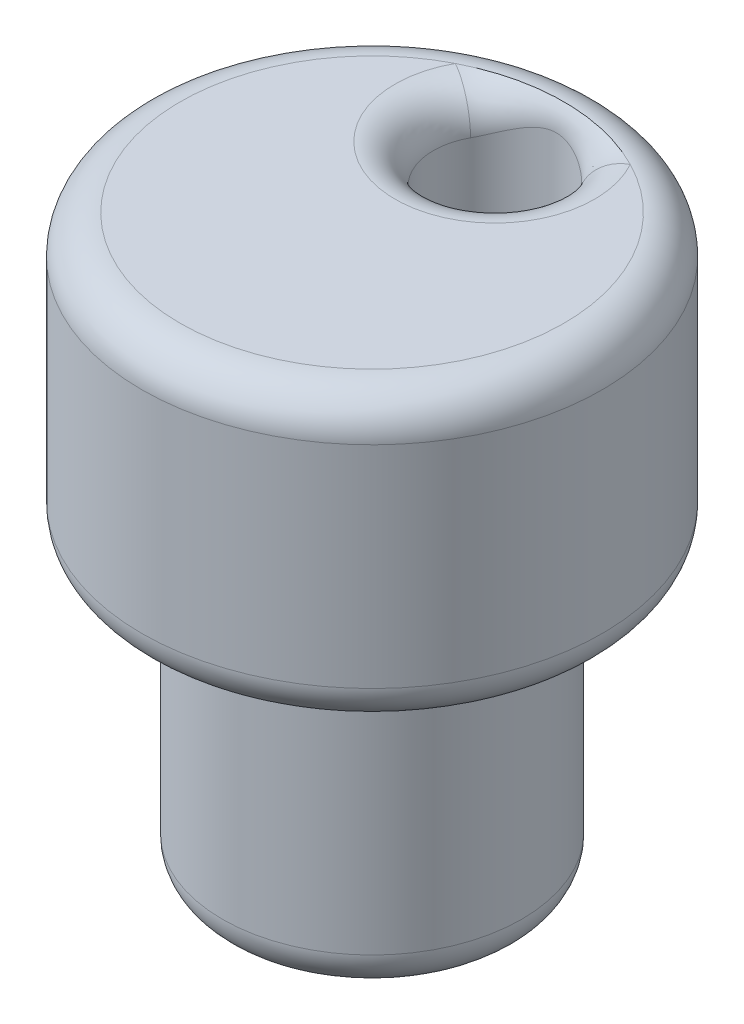
ISO-10303-21;
HEADER;
FILE_DESCRIPTION(('STEP AP214'),'2;1');
FILE_NAME('part.step','',(''),(''),'','','');
FILE_SCHEMA(('AUTOMOTIVE_DESIGN { 1 0 10303 214 1 1 1 1 }'));
ENDSEC;
DATA;
#1=APPLICATION_CONTEXT('core data for automotive mechanical design processes');
#2=APPLICATION_PROTOCOL_DEFINITION('international standard','automotive_design',2000,#1);
#3=PRODUCT_CONTEXT('',#1,'mechanical');
#4=PRODUCT('Part','Part','',(#3));
#5=PRODUCT_RELATED_PRODUCT_CATEGORY('part','',(#4));
#6=PRODUCT_DEFINITION_FORMATION('','',#4);
#7=PRODUCT_DEFINITION_CONTEXT('part definition',#1,'design');
#8=PRODUCT_DEFINITION('design','',#6,#7);
#9=PRODUCT_DEFINITION_SHAPE('','',#8);
#10=(LENGTH_UNIT() NAMED_UNIT(*) SI_UNIT(.MILLI.,.METRE.));
#11=(NAMED_UNIT(*) PLANE_ANGLE_UNIT() SI_UNIT($,.RADIAN.));
#12=(NAMED_UNIT(*) SI_UNIT($,.STERADIAN.) SOLID_ANGLE_UNIT());
#13=UNCERTAINTY_MEASURE_WITH_UNIT(LENGTH_MEASURE(1.E-05),#10,'distance_accuracy_value','');
#14=(GEOMETRIC_REPRESENTATION_CONTEXT(3) GLOBAL_UNCERTAINTY_ASSIGNED_CONTEXT((#13)) GLOBAL_UNIT_ASSIGNED_CONTEXT((#10,
#11,#12)) REPRESENTATION_CONTEXT('',''));
#15=CARTESIAN_POINT('',(0.,0.,0.));
#16=DIRECTION('',(0.,0.,1.));
#17=DIRECTION('',(1.,0.,0.));
#18=AXIS2_PLACEMENT_3D('',#15,#16,#17);
#19=CARTESIAN_POINT('',(0.,7.5,0.));
#20=DIRECTION('',(0.,-1.,0.));
#21=DIRECTION('',(0.,0.,-1.));
#22=AXIS2_PLACEMENT_3D('',#19,#20,#21);
#23=CYLINDRICAL_SURFACE('',#22,3.9);
#24=CARTESIAN_POINT('',(0.,1.,0.));
#25=DIRECTION('',(0.,1.,0.));
#26=DIRECTION('',(0.,0.,1.));
#27=AXIS2_PLACEMENT_3D('',#24,#25,#26);
#28=CIRCLE('',#27,3.9);
#29=CARTESIAN_POINT('',(0.,1.,3.9));
#30=VERTEX_POINT('',#29);
#31=EDGE_CURVE('E120',#30,#30,#28,.T.);
#32=ORIENTED_EDGE('',*,*,#31,.T.);
#33=EDGE_LOOP('',(#32));
#34=FACE_BOUND('',#33,.T.);
#35=CARTESIAN_POINT('',(0.,7.5,0.));
#36=DIRECTION('',(0.,1.,0.));
#37=DIRECTION('',(0.,0.,1.));
#38=AXIS2_PLACEMENT_3D('',#35,#36,#37);
#39=CIRCLE('',#38,3.9);
#40=CARTESIAN_POINT('',(0.,7.5,3.9));
#41=VERTEX_POINT('',#40);
#42=EDGE_CURVE('E113',#41,#41,#39,.T.);
#43=ORIENTED_EDGE('',*,*,#42,.F.);
#44=EDGE_LOOP('',(#43));
#45=FACE_BOUND('',#44,.T.);
#46=ADVANCED_FACE('F37',(#34,#45),#23,.T.);
#47=CARTESIAN_POINT('',(0.,0.,0.));
#48=DIRECTION('',(0.,1.,0.));
#49=DIRECTION('',(0.,0.,1.));
#50=AXIS2_PLACEMENT_3D('',#47,#48,#49);
#51=PLANE('',#50);
#52=CARTESIAN_POINT('',(0.,0.,0.));
#53=DIRECTION('',(0.,1.,0.));
#54=DIRECTION('',(0.,0.,1.));
#55=AXIS2_PLACEMENT_3D('',#52,#53,#54);
#56=CIRCLE('',#55,2.9);
#57=CARTESIAN_POINT('',(0.,0.,2.9));
#58=VERTEX_POINT('',#57);
#59=EDGE_CURVE('E125',#58,#58,#56,.F.);
#60=ORIENTED_EDGE('',*,*,#59,.T.);
#61=EDGE_LOOP('',(#60));
#62=FACE_BOUND('',#61,.T.);
#63=ADVANCED_FACE('F151',(#62),#51,.F.);
#64=CARTESIAN_POINT('',(0.,7.5,0.));
#65=DIRECTION('',(0.,1.,0.));
#66=DIRECTION('',(0.,0.,1.));
#67=AXIS2_PLACEMENT_3D('',#64,#65,#66);
#68=PLANE('',#67);
#69=CARTESIAN_POINT('',(0.,7.5,0.));
#70=DIRECTION('',(0.,1.,0.));
#71=DIRECTION('',(0.,0.,1.));
#72=AXIS2_PLACEMENT_3D('',#69,#70,#71);
#73=CIRCLE('',#72,5.);
#74=CARTESIAN_POINT('',(0.,7.5,5.));
#75=VERTEX_POINT('',#74);
#76=EDGE_CURVE('E134',#75,#75,#73,.F.);
#77=ORIENTED_EDGE('',*,*,#76,.T.);
#78=EDGE_LOOP('',(#77));
#79=FACE_BOUND('',#78,.T.);
#80=ORIENTED_EDGE('',*,*,#42,.T.);
#81=EDGE_LOOP('',(#80));
#82=FACE_BOUND('',#81,.T.);
#83=ADVANCED_FACE('F158',(#79,#82),#68,.F.);
#84=CARTESIAN_POINT('',(0.,15.,0.));
#85=DIRECTION('',(0.,1.,0.));
#86=DIRECTION('',(0.,0.,1.));
#87=AXIS2_PLACEMENT_3D('',#84,#85,#86);
#88=PLANE('',#87);
#89=CARTESIAN_POINT('',(0.,15.,0.));
#90=DIRECTION('',(0.,1.,0.));
#91=DIRECTION('',(0.,0.,1.));
#92=AXIS2_PLACEMENT_3D('',#89,#90,#91);
#93=CIRCLE('',#92,5.);
#94=CARTESIAN_POINT('',(-2.2798026230356,15.,-4.45));
#95=VERTEX_POINT('',#94);
#96=CARTESIAN_POINT('',(2.2798026230356,15.,-4.45));
#97=VERTEX_POINT('',#96);
#98=EDGE_CURVE('E136',#95,#97,#93,.T.);
#99=ORIENTED_EDGE('',*,*,#98,.T.);
#100=CARTESIAN_POINT('',(0.,15.,-3.2));
#101=DIRECTION('',(0.,1.,0.));
#102=DIRECTION('',(0.,0.,1.));
#103=AXIS2_PLACEMENT_3D('',#100,#101,#102);
#104=CIRCLE('',#103,2.6);
#105=EDGE_CURVE('E11',#97,#95,#104,.F.);
#106=ORIENTED_EDGE('',*,*,#105,.T.);
#107=EDGE_LOOP('',(#99,#106));
#108=FACE_BOUND('',#107,.T.);
#109=ADVANCED_FACE('F101',(#108),#88,.T.);
#110=CARTESIAN_POINT('',(0.,15.,0.));
#111=DIRECTION('',(0.,-1.,0.));
#112=DIRECTION('',(0.,0.,-1.));
#113=AXIS2_PLACEMENT_3D('',#110,#111,#112);
#114=CYLINDRICAL_SURFACE('',#113,6.);
#115=CARTESIAN_POINT('',(0.,8.5,0.));
#116=DIRECTION('',(0.,1.,0.));
#117=DIRECTION('',(0.,0.,1.));
#118=AXIS2_PLACEMENT_3D('',#115,#116,#117);
#119=CIRCLE('',#118,6.);
#120=CARTESIAN_POINT('',(0.,8.5,6.));
#121=VERTEX_POINT('',#120);
#122=EDGE_CURVE('E131',#121,#121,#119,.T.);
#123=ORIENTED_EDGE('',*,*,#122,.T.);
#124=EDGE_LOOP('',(#123));
#125=FACE_BOUND('',#124,.T.);
#126=CARTESIAN_POINT('',(0.,14.,0.));
#127=DIRECTION('',(0.,1.,0.));
#128=DIRECTION('',(0.,0.,1.));
#129=AXIS2_PLACEMENT_3D('',#126,#127,#128);
#130=CIRCLE('',#129,6.);
#131=CARTESIAN_POINT('',(0.,14.,6.));
#132=VERTEX_POINT('',#131);
#133=EDGE_CURVE('E128',#132,#132,#130,.F.);
#134=ORIENTED_EDGE('',*,*,#133,.T.);
#135=EDGE_LOOP('',(#134));
#136=FACE_BOUND('',#135,.T.);
#137=ADVANCED_FACE('F100',(#125,#136),#114,.T.);
#138=CARTESIAN_POINT('',(0.,15.,-3.2));
#139=DIRECTION('',(0.,-1.,0.));
#140=DIRECTION('',(0.,0.,-1.));
#141=AXIS2_PLACEMENT_3D('',#138,#139,#140);
#142=CYLINDRICAL_SURFACE('',#141,1.6);
#143=CARTESIAN_POINT('',(0.,14.,-3.2));
#144=DIRECTION('',(0.,1.,0.));
#145=DIRECTION('',(0.,0.,1.));
#146=AXIS2_PLACEMENT_3D('',#143,#144,#145);
#147=CIRCLE('',#146,1.6);
#148=CARTESIAN_POINT('',(-1.4029554603296,14.,-3.96923076923077));
#149=VERTEX_POINT('',#148);
#150=CARTESIAN_POINT('',(1.4029554603296,14.,-3.96923076923077));
#151=VERTEX_POINT('',#150);
#152=EDGE_CURVE('E79',#149,#151,#147,.T.);
#153=ORIENTED_EDGE('',*,*,#152,.T.);
#154=CARTESIAN_POINT('',(-1.56517969796609,14.1213914552648,-3.53198269996307));
#155=CARTESIAN_POINT('',(-1.46052548346698,15.4620702694201,-4.02538989214152));
#156=CARTESIAN_POINT('',(-2.81198565296933,15.,-4.1343363055628));
#157=CARTESIAN_POINT('',(-1.56000704476624,14.1061404723442,-3.55639603324826));
#158=CARTESIAN_POINT('',(-1.45758998799145,15.4351397029921,-4.00175433175512));
#159=CARTESIAN_POINT('',(-2.78523140894051,15.,-4.15253655955672));
#160=CARTESIAN_POINT('',(-1.55417522746212,14.0926105137381,-3.58104962464937));
#161=CARTESIAN_POINT('',(-1.45522266257107,15.4068679798011,-3.98225687630718));
#162=CARTESIAN_POINT('',(-2.7577964952291,15.,-4.17081324158655));
#163=CARTESIAN_POINT('',(-1.54119388702393,14.0686972055903,-3.63054760169637));
#164=CARTESIAN_POINT('',(-1.45095060143005,15.3499506763346,-3.95152357586537));
#165=CARTESIAN_POINT('',(-2.70179310193058,15.,-4.2073059656368));
#166=CARTESIAN_POINT('',(-1.53404631214803,14.058309262962,-3.65539165387123));
#167=CARTESIAN_POINT('',(-1.44903434920668,15.3213247159363,-3.94007426895664));
#168=CARTESIAN_POINT('',(-2.67322634672196,15.,-4.22552205729683));
#169=CARTESIAN_POINT('',(-1.51072571561993,14.0314962617759,-3.72950238053242));
#170=CARTESIAN_POINT('',(-1.44302358423875,15.2383492168914,-3.91693757417995));
#171=CARTESIAN_POINT('',(-2.58649589267453,15.,-4.27956180849336));
#172=CARTESIAN_POINT('',(-1.4925952709148,14.0191972513533,-3.77873127205016));
#173=CARTESIAN_POINT('',(-1.43852946627457,15.184264404814,-3.91454808504395));
#174=CARTESIAN_POINT('',(-2.52688422704077,15.,-4.31506285900807));
#175=CARTESIAN_POINT('',(-1.44487360844206,14.000966319414,-3.89073634987857));
#176=CARTESIAN_POINT('',(-1.42260492673218,15.070918150363,-3.93187839422049));
#177=CARTESIAN_POINT('',(-2.3858793823658,15.,-4.39500226535915));
#178=CARTESIAN_POINT('',(-1.41347136332483,13.998235773458,-3.9529255673471));
#179=CARTESIAN_POINT('',(-1.4096819320219,15.0133180233244,-3.95727009307763));
#180=CARTESIAN_POINT('',(-2.30351261410998,15.,-4.43875663594681));
#181=CARTESIAN_POINT('',(-1.34286052547129,14.0038008855801,-4.07269268728156));
#182=CARTESIAN_POINT('',(-1.37173854388263,14.9163727969477,-4.02570564944266));
#183=CARTESIAN_POINT('',(-2.13547112723714,15.,-4.52201474186924));
#184=CARTESIAN_POINT('',(-1.30362275015083,14.0121384416612,-4.13025218760675));
#185=CARTESIAN_POINT('',(-1.34716087067513,14.8759662965792,-4.06813684085286));
#186=CARTESIAN_POINT('',(-2.04978503774029,15.,-4.56150170998706));
#187=CARTESIAN_POINT('',(-1.20788967765028,14.0396017728561,-4.25282430652819));
#188=CARTESIAN_POINT('',(-1.27838963185258,14.8033525119137,-4.17012318680835));
#189=CARTESIAN_POINT('',(-1.85483340617653,15.,-4.64471842048722));
#190=CARTESIAN_POINT('',(-1.14952304750645,14.0608752671675,-4.31619219454149));
#191=CARTESIAN_POINT('',(-1.2310027574101,14.7737478803093,-4.23194121967962));
#192=CARTESIAN_POINT('',(-1.74494818344201,15.,-4.68710598389683));
#193=CARTESIAN_POINT('',(-1.02407668130393,14.1103429225671,-4.43231035606159));
#194=CARTESIAN_POINT('',(-1.11922852971684,14.7325538468819,-4.35272999557708));
#195=CARTESIAN_POINT('',(-1.5225902870196,15.,-4.76398878683802));
#196=CARTESIAN_POINT('',(-0.956993778602847,14.1385396021932,-4.4850567529107));
#197=CARTESIAN_POINT('',(-1.05505322719279,14.7200955821751,-4.41229917903587));
#198=CARTESIAN_POINT('',(-1.4101166852477,15.,-4.79848114538416));
#199=CARTESIAN_POINT('',(-0.814843859728575,14.1975653726468,-4.579636900622));
#200=CARTESIAN_POINT('',(-0.912165198422788,14.7066727112544,-4.52224864270928));
#201=CARTESIAN_POINT('',(-1.18152291460142,15.,-4.85985235002485));
#202=CARTESIAN_POINT('',(-0.739698066370876,14.2284197202119,-4.62134595354129));
#203=CARTESIAN_POINT('',(-0.833133388603959,14.7054236452762,-4.5732776749934));
#204=CARTESIAN_POINT('',(-1.06537641252278,15.,-4.88664446913413));
#205=CARTESIAN_POINT('',(-0.583342381270456,14.2872187539032,-4.69233968110735));
#206=CARTESIAN_POINT('',(-0.664177102734049,14.708863993184,-4.66115316518435));
#207=CARTESIAN_POINT('',(-0.830448089649544,15.,-4.93200357741621));
#208=CARTESIAN_POINT('',(-0.502135201019976,14.3151647278199,-4.72162987247934));
#209=CARTESIAN_POINT('',(-0.573834236618258,14.7134362977656,-4.69865340567625));
#210=CARTESIAN_POINT('',(-0.711667463717478,15.,-4.95057421890828));
#211=CARTESIAN_POINT('',(-0.346027773971012,14.3585062284897,-4.76394143291196));
#212=CARTESIAN_POINT('',(-0.397824284728202,14.7223100119492,-4.75293909468703));
#213=CARTESIAN_POINT('',(-0.487137783938594,15.,-4.97732193751414));
#214=CARTESIAN_POINT('',(-0.271699093937274,14.375067738129,-4.77859376202145));
#215=CARTESIAN_POINT('',(-0.312779987560021,14.7265846738525,-4.77208169057779));
#216=CARTESIAN_POINT('',(-0.381725039524723,15.,-4.98654342014264));
#217=CARTESIAN_POINT('',(-0.121161862191813,14.3965013468153,-4.79719910824125));
#218=CARTESIAN_POINT('',(-0.140022928639884,14.7322725305875,-4.79628835343642));
#219=CARTESIAN_POINT('',(-0.169651533938549,15.,-4.99824421091205));
#220=CARTESIAN_POINT('',(-0.0449574873981453,14.4013973970757,-4.80117405002447));
#221=CARTESIAN_POINT('',(-0.0517952955058165,14.7337246800281,-4.80153238416168));
#222=CARTESIAN_POINT('',(-0.0629937825166214,15.,-5.00073733494116));
#223=CARTESIAN_POINT('',(0.107182243196061,14.3978796615497,-4.79822090723551));
#224=CARTESIAN_POINT('',(0.123628969451663,14.7327378517704,-4.79767549963337));
#225=CARTESIAN_POINT('',(0.150166160867887,15.,-4.99888270789748));
#226=CARTESIAN_POINT('',(0.183117254997685,14.3894525997516,-4.79128194738042));
#227=CARTESIAN_POINT('',(0.211382584682557,14.730288479037,-4.78853556496017));
#228=CARTESIAN_POINT('',(0.256668091684682,15.,-4.9945281333575));
#229=CARTESIAN_POINT('',(0.332598956044211,14.362031187985,-4.76688791254372));
#230=CARTESIAN_POINT('',(0.382307314689241,14.7233320545518,-4.75688812505108));
#231=CARTESIAN_POINT('',(0.46812625188468,15.,-4.97917094484059));
#232=CARTESIAN_POINT('',(0.406140744143849,14.343016439843,-4.74941253275921));
#233=CARTESIAN_POINT('',(0.465969657610754,14.7187843680366,-4.73415890510732));
#234=CARTESIAN_POINT('',(0.573079094908994,15.,-4.9681554945273));
#235=CARTESIAN_POINT('',(0.551207525865842,14.2985197081189,-4.70402619353275));
#236=CARTESIAN_POINT('',(0.628158481198143,14.7108425402119,-4.6763477405006));
#237=CARTESIAN_POINT('',(0.783488291774417,15.,-4.93940385529107));
#238=CARTESIAN_POINT('',(0.622634608735343,14.2728864546251,-4.67586271201556));
#239=CARTESIAN_POINT('',(0.706891291035974,14.7074745438992,-4.64062230884013));
#240=CARTESIAN_POINT('',(0.888890362217364,15.,-4.92150488406748));
#241=CARTESIAN_POINT('',(0.760549068045353,14.2198833698404,-4.60975731107108));
#242=CARTESIAN_POINT('',(0.854833343335143,14.7057987814992,-4.55930940816504));
#243=CARTESIAN_POINT('',(1.09762893573418,15.,-4.8791961663836));
#244=CARTESIAN_POINT('',(0.827034755055234,14.1925129504995,-4.57181206695657));
#245=CARTESIAN_POINT('',(0.924317184842421,14.707593957311,-4.51324772904065));
#246=CARTESIAN_POINT('',(1.20096472361366,15.,-4.85478420614869));
#247=CARTESIAN_POINT('',(0.966171741755209,14.1347168868564,-4.47858774840641));
#248=CARTESIAN_POINT('',(1.06429345576253,14.7212507770093,-4.4047341602297));
#249=CARTESIAN_POINT('',(1.42508173209051,15.,-4.79427180791756));
#250=CARTESIAN_POINT('',(1.03761276180448,14.1046917518164,-4.42138792042506));
#251=CARTESIAN_POINT('',(1.13220588683724,14.7353742743805,-4.34034652494598));
#252=CARTESIAN_POINT('',(1.54546814641405,15.,-4.75683418358067));
#253=CARTESIAN_POINT('',(1.17031485141794,14.0530856010732,-4.29487106125612));
#254=CARTESIAN_POINT('',(1.24871701875924,14.7829140939446,-4.21058874913149));
#255=CARTESIAN_POINT('',(1.78324138049779,15.,-4.67288972093194));
#256=CARTESIAN_POINT('',(1.23157930148393,14.0315017780546,-4.22555806964094));
#257=CARTESIAN_POINT('',(1.29700385265564,14.8174729015653,-4.14451494004706));
#258=CARTESIAN_POINT('',(1.90062918534135,15.,-4.62638590547376));
#259=CARTESIAN_POINT('',(1.32626295237414,14.0072337128465,-4.09748779293032));
#260=CARTESIAN_POINT('',(1.36164920996061,14.8984784018259,-4.04396999931107));
#261=CARTESIAN_POINT('',(2.09889857150275,15.,-4.53903855242876));
#262=CARTESIAN_POINT('',(1.36267868818246,14.0009529388075,-4.04119589596174));
#263=CARTESIAN_POINT('',(1.38314593197222,14.9402829013981,-4.00536260782014));
#264=CARTESIAN_POINT('',(2.18081228627762,15.,-4.50024654927233));
#265=CARTESIAN_POINT('',(1.42808330995254,13.9992482016009,-3.92457792973956));
#266=CARTESIAN_POINT('',(1.41607131865337,15.0388858001636,-3.94530681264278));
#267=CARTESIAN_POINT('',(2.34134902458838,15.,-4.41883734089817));
#268=CARTESIAN_POINT('',(1.45710137007978,14.0037808368376,-3.8642689289072));
#269=CARTESIAN_POINT('',(1.42709918537686,15.0966549756802,-3.9245315081858));
#270=CARTESIAN_POINT('',(2.41998391851813,15.,-4.37623608580472));
#271=CARTESIAN_POINT('',(1.50115986101556,14.0246860301704,-3.75595104030504));
#272=CARTESIAN_POINT('',(1.44084494461284,15.2088376398368,-3.91507466716365));
#273=CARTESIAN_POINT('',(2.55461961046241,15.,-4.29865608689676));
#274=CARTESIAN_POINT('',(1.51788306978282,14.0379982312853,-3.70841417469922));
#275=CARTESIAN_POINT('',(1.44479964291577,15.2618701373465,-3.92084707842167));
#276=CARTESIAN_POINT('',(2.61156815801526,15.,-4.26426340973799));
#277=CARTESIAN_POINT('',(1.53936256352182,14.0659517240178,-3.63702249017285));
#278=CARTESIAN_POINT('',(1.45048391912685,15.3423928715637,-3.9483809790357));
#279=CARTESIAN_POINT('',(2.69437334073296,15.,-4.21205781912506));
#280=CARTESIAN_POINT('',(1.54593959182227,14.0766566539834,-3.61311962734277));
#281=CARTESIAN_POINT('',(1.45237559106896,15.3700050661998,-3.96119299662191));
#282=CARTESIAN_POINT('',(2.72163760791723,15.,-4.19448504807207));
#283=CARTESIAN_POINT('',(1.55787643092154,14.101040990887,-3.56554981971351));
#284=CARTESIAN_POINT('',(1.45671635169083,15.4245963934463,-3.99428460997835));
#285=CARTESIAN_POINT('',(2.77507169046773,15.,-4.15932766863547));
#286=CARTESIAN_POINT('',(1.56323453005588,14.114724528407,-3.54188325074302));
#287=CARTESIAN_POINT('',(1.45917960731354,15.451547089633,-4.01475919537554));
#288=CARTESIAN_POINT('',(2.8012399252143,15.,-4.14174307796134));
#289=CARTESIAN_POINT('',(1.56798490732745,14.1300309163273,-3.51847029750565));
#290=CARTESIAN_POINT('',(1.46224029981105,15.4770632400406,-4.03910267646096));
#291=CARTESIAN_POINT('',(2.82675344374394,15.,-4.12425326189866));
#292=(BOUNDED_SURFACE() B_SPLINE_SURFACE(3,2,((#154,#155,#156),(#157,#158,#159),(#160,#161,
#162),(#163,#164,#165),(#166,#167,#168),(#169,#170,#171),(#172,#173,#174),(#175,#176,#177),
(#178,#179,#180),(#181,#182,#183),(#184,#185,#186),(#187,#188,#189),(#190,#191,#192),(#193,#194,
#195),(#196,#197,#198),(#199,#200,#201),(#202,#203,#204),(#205,#206,#207),(#208,#209,#210),
(#211,#212,#213),(#214,#215,#216),(#217,#218,#219),(#220,#221,#222),(#223,#224,#225),(#226,#227,
#228),(#229,#230,#231),(#232,#233,#234),(#235,#236,#237),(#238,#239,#240),(#241,#242,#243),
(#244,#245,#246),(#247,#248,#249),(#250,#251,#252),(#253,#254,#255),(#256,#257,#258),(#259,#260,
#261),(#262,#263,#264),(#265,#266,#267),(#268,#269,#270),(#271,#272,#273),(#274,#275,#276),
(#277,#278,#279),(#280,#281,#282),(#283,#284,#285),(#286,#287,#288),(#289,#290,#291)),
.UNSPECIFIED.,.F.,.F.,.F.) B_SPLINE_SURFACE_WITH_KNOTS((4,2,2,2,2,2,2,2,2,2,2,2,2,2,2,2,2,2,2,2,
2,2,4),(3,3),(0.,0.129862435405041,0.259534106447141,0.516878120479335,0.854835835319832,
1.19407653512535,1.61668791445138,2.03945326104546,2.46680863737665,2.89397397386042,
3.26506158999256,3.6353866397724,4.00608093805995,4.37749189726397,4.75828741142767,
5.13921252381517,5.59214543975352,6.04492759606881,6.37114172394983,6.69604873600814,
6.94395971542726,7.06887072346208,7.19395606798141),(0.,1.),
.UNSPECIFIED.) GEOMETRIC_REPRESENTATION_ITEM() RATIONAL_B_SPLINE_SURFACE(((1.,0.572427303137215,
1.),(1.,0.579958413294435,1.),(1.,0.587579779570056,1.),(1.,0.602892676313989,1.),(1.,
0.610584087267026,1.),(1.,0.633513651594366,1.),(1.,0.648726127692178,1.),(1.,0.683179528225893,
1.),(1.,0.702189616610808,1.),(1.,0.738497191813468,1.),(1.,0.755787903131983,1.),(1.,
0.792290167892561,1.),(1.,0.810929485117061,1.),(1.,0.844759139815267,1.),(1.,0.859948218270481,
1.),(1.,0.886975512922767,1.),(1.,0.898775557826225,1.),(1.,0.91875038790331,1.),(1.,
0.926926782853345,1.),(1.,0.938701954758269,1.),(1.,0.94276076272695,1.),(1.,0.94791064494017,
1.),(1.,0.949007800588364,1.),(1.,0.948191576505967,1.),(1.,0.946275193900895,1.),(1.,
0.93951568734351,1.),(1.,0.934666912303584,1.),(1.,0.922008566756303,1.),(1.,0.91412728055566,
1.),(1.,0.895495253557805,1.),(1.,0.884743537096264,1.),(1.,0.858094494669072,1.),(1.,
0.84160867379702,1.),(1.,0.804677405669432,1.),(1.,0.784233278209894,1.),(1.,0.745953098617568,
1.),(1.,0.728985490101367,1.),(1.,0.693535240631959,1.),(1.,0.675058942724065,1.),(1.,
0.641693171670113,1.),(1.,0.626991305961609,1.),(1.,0.604898396020804,1.),(1.,0.597499138726884,
1.),(1.,0.582788346624543,1.),(1.,0.575476948662419,1.),(1.,0.568261067915251,1.))) REPRESENTATION_ITEM('') SURFACE());
#293=CARTESIAN_POINT('',(1.56798490732745,14.1300309163273,-3.51847029750565));
#294=CARTESIAN_POINT('',(1.56323453005588,14.114724528407,-3.54188325074302));
#295=CARTESIAN_POINT('',(1.55787643092154,14.101040990887,-3.56554981971351));
#296=CARTESIAN_POINT('',(1.54593959182227,14.0766566539834,-3.61311962734277));
#297=CARTESIAN_POINT('',(1.53936256352182,14.0659517240178,-3.63702249017285));
#298=CARTESIAN_POINT('',(1.51788306978282,14.0379982312853,-3.70841417469922));
#299=CARTESIAN_POINT('',(1.50115986101556,14.0246860301704,-3.75595104030504));
#300=CARTESIAN_POINT('',(1.45710137007978,14.0037808368376,-3.8642689289072));
#301=CARTESIAN_POINT('',(1.42808330995254,13.9992482016009,-3.92457792973956));
#302=CARTESIAN_POINT('',(1.36267868818246,14.0009529388075,-4.04119589596174));
#303=CARTESIAN_POINT('',(1.32626295237414,14.0072337128465,-4.09748779293032));
#304=CARTESIAN_POINT('',(1.23157930148393,14.0315017780546,-4.22555806964094));
#305=CARTESIAN_POINT('',(1.17031485141794,14.0530856010732,-4.29487106125612));
#306=CARTESIAN_POINT('',(1.03761276180448,14.1046917518164,-4.42138792042506));
#307=CARTESIAN_POINT('',(0.966171741755209,14.1347168868564,-4.47858774840641));
#308=CARTESIAN_POINT('',(0.827034755055234,14.1925129504995,-4.57181206695657));
#309=CARTESIAN_POINT('',(0.760549068045353,14.2198833698404,-4.60975731107108));
#310=CARTESIAN_POINT('',(0.622634608735343,14.2728864546251,-4.67586271201556));
#311=CARTESIAN_POINT('',(0.551207525865842,14.2985197081189,-4.70402619353275));
#312=CARTESIAN_POINT('',(0.406140744143849,14.343016439843,-4.74941253275921));
#313=CARTESIAN_POINT('',(0.33259895604421,14.362031187985,-4.76688791254372));
#314=CARTESIAN_POINT('',(0.183117254997685,14.3894525997516,-4.79128194738042));
#315=CARTESIAN_POINT('',(0.107182243196061,14.3978796615497,-4.79822090723551));
#316=CARTESIAN_POINT('',(-0.0449574873981453,14.4013973970757,-4.80117405002447));
#317=CARTESIAN_POINT('',(-0.121161862191813,14.3965013468153,-4.79719910824125));
#318=CARTESIAN_POINT('',(-0.271699093937273,14.375067738129,-4.77859376202145));
#319=CARTESIAN_POINT('',(-0.346027773971012,14.3585062284897,-4.76394143291196));
#320=CARTESIAN_POINT('',(-0.502135201019976,14.3151647278199,-4.72162987247934));
#321=CARTESIAN_POINT('',(-0.583342381270456,14.2872187539032,-4.69233968110735));
#322=CARTESIAN_POINT('',(-0.739698066370876,14.2284197202119,-4.62134595354129));
#323=CARTESIAN_POINT('',(-0.814843859728575,14.1975653726468,-4.579636900622));
#324=CARTESIAN_POINT('',(-0.956993778602847,14.1385396021932,-4.4850567529107));
#325=CARTESIAN_POINT('',(-1.02407668130393,14.1103429225671,-4.43231035606159));
#326=CARTESIAN_POINT('',(-1.14952304750645,14.0608752671675,-4.3161921945415));
#327=CARTESIAN_POINT('',(-1.20788967765027,14.0396017728561,-4.25282430652819));
#328=CARTESIAN_POINT('',(-1.30362275015083,14.0121384416612,-4.13025218760675));
#329=CARTESIAN_POINT('',(-1.34286052547129,14.0038008855801,-4.07269268728156));
#330=CARTESIAN_POINT('',(-1.41347136332483,13.998235773458,-3.9529255673471));
#331=CARTESIAN_POINT('',(-1.44487360844206,14.000966319414,-3.89073634987857));
#332=CARTESIAN_POINT('',(-1.4925952709148,14.0191972513533,-3.77873127205016));
#333=CARTESIAN_POINT('',(-1.51072571561993,14.0314962617759,-3.72950238053242));
#334=CARTESIAN_POINT('',(-1.53404631214803,14.058309262962,-3.65539165387123));
#335=CARTESIAN_POINT('',(-1.54119388702393,14.0686972055903,-3.63054760169637));
#336=CARTESIAN_POINT('',(-1.55417522746212,14.0926105137381,-3.58104962464937));
#337=CARTESIAN_POINT('',(-1.56000704476624,14.1061404723442,-3.55639603324826));
#338=CARTESIAN_POINT('',(-1.56517969796609,14.1213914552648,-3.53198269996307));
#339=B_SPLINE_CURVE_WITH_KNOTS('',3,(#293,#294,#295,#296,#297,#298,#299,#300,#301,#302,#303,
#304,#305,#306,#307,#308,#309,#310,#311,#312,#313,#314,#315,#316,#317,#318,#319,#320,#321,#322,
#323,#324,#325,#326,#327,#328,#329,#330,#331,#332,#333,#334,#335,#336,#337,#338),.UNSPECIFIED.,
.F.,.F.,(4,2,2,2,2,2,2,2,2,2,2,2,2,2,2,2,2,2,2,2,2,2,4),(0.,0.125085344519328,0.249996352554146,
0.497907331973267,0.822814344031583,1.1490284719126,1.60181062822789,2.05474354416624,
2.43566865655375,2.81646417071744,3.18787512992146,3.55856942820902,3.92889447798885,
4.29998209412099,4.72714743060476,5.15450280693595,5.57726815353003,5.99987953285606,
6.33912023266158,6.67707794750208,6.93442196153427,7.06409363257637,7.19395606798141),.UNSPECIFIED.);
#340=EDGE_CURVE('E51',#151,#149,#339,.T.);
#341=ORIENTED_EDGE('',*,*,#340,.T.);
#342=EDGE_LOOP('',(#153,#341));
#343=FACE_BOUND('',#342,.T.);
#344=CARTESIAN_POINT('',(0.,8.5,-3.2));
#345=DIRECTION('',(0.,1.,0.));
#346=DIRECTION('',(0.,0.,1.));
#347=AXIS2_PLACEMENT_3D('',#344,#345,#346);
#348=CIRCLE('',#347,1.6);
#349=CARTESIAN_POINT('',(0.,8.5,-1.6));
#350=VERTEX_POINT('',#349);
#351=EDGE_CURVE('E115',#350,#350,#348,.T.);
#352=ORIENTED_EDGE('',*,*,#351,.F.);
#353=EDGE_LOOP('',(#352));
#354=FACE_BOUND('',#353,.T.);
#355=ADVANCED_FACE('F82',(#343,#354),#142,.F.);
#356=CARTESIAN_POINT('',(0.,8.5,-3.2));
#357=DIRECTION('',(0.,1.,0.));
#358=DIRECTION('',(0.,0.,1.));
#359=AXIS2_PLACEMENT_3D('',#356,#357,#358);
#360=PLANE('',#359);
#361=ORIENTED_EDGE('',*,*,#351,.T.);
#362=EDGE_LOOP('',(#361));
#363=FACE_BOUND('',#362,.T.);
#364=ADVANCED_FACE('F99',(#363),#360,.T.);
#365=CARTESIAN_POINT('',(0.,1.,0.));
#366=DIRECTION('',(0.,1.,0.));
#367=DIRECTION('',(0.,0.,1.));
#368=AXIS2_PLACEMENT_3D('',#365,#366,#367);
#369=TOROIDAL_SURFACE('',#368,2.9,1.);
#370=ORIENTED_EDGE('',*,*,#59,.F.);
#371=EDGE_LOOP('',(#370));
#372=FACE_BOUND('',#371,.T.);
#373=ORIENTED_EDGE('',*,*,#31,.F.);
#374=EDGE_LOOP('',(#373));
#375=FACE_BOUND('',#374,.T.);
#376=ADVANCED_FACE('F146',(#372,#375),#369,.T.);
#377=CARTESIAN_POINT('',(0.,8.5,0.));
#378=DIRECTION('',(0.,1.,0.));
#379=DIRECTION('',(0.,0.,1.));
#380=AXIS2_PLACEMENT_3D('',#377,#378,#379);
#381=TOROIDAL_SURFACE('',#380,5.,1.);
#382=ORIENTED_EDGE('',*,*,#76,.F.);
#383=EDGE_LOOP('',(#382));
#384=FACE_BOUND('',#383,.T.);
#385=ORIENTED_EDGE('',*,*,#122,.F.);
#386=EDGE_LOOP('',(#385));
#387=FACE_BOUND('',#386,.T.);
#388=ADVANCED_FACE('F140',(#384,#387),#381,.T.);
#389=CARTESIAN_POINT('',(0.,14.,0.));
#390=DIRECTION('',(0.,1.,0.));
#391=DIRECTION('',(0.,0.,1.));
#392=AXIS2_PLACEMENT_3D('',#389,#390,#391);
#393=TOROIDAL_SURFACE('',#392,5.,1.);
#394=ORIENTED_EDGE('',*,*,#133,.F.);
#395=EDGE_LOOP('',(#394));
#396=FACE_BOUND('',#395,.T.);
#397=EDGE_CURVE('E76',#97,#95,#93,.T.);
#398=ORIENTED_EDGE('',*,*,#397,.F.);
#399=ORIENTED_EDGE('',*,*,#98,.F.);
#400=EDGE_LOOP('',(#398,#399));
#401=FACE_BOUND('',#400,.T.);
#402=ADVANCED_FACE('F138',(#396,#401),#393,.T.);
#403=CARTESIAN_POINT('',(0.,14.,-3.2));
#404=DIRECTION('',(0.,1.,0.));
#405=DIRECTION('',(0.,0.,1.));
#406=AXIS2_PLACEMENT_3D('',#403,#404,#405);
#407=TOROIDAL_SURFACE('',#406,2.6,1.);
#408=CARTESIAN_POINT('',(-2.2798026230356,14.,-4.45));
#409=DIRECTION('',(0.480769230769232,0.,-0.876847162705999));
#410=DIRECTION('',(-0.876847162705999,0.,-0.480769230769232));
#411=AXIS2_PLACEMENT_3D('',#408,#409,#410);
#412=CIRCLE('',#411,1.);
#413=EDGE_CURVE('E71',#95,#149,#412,.T.);
#414=ORIENTED_EDGE('',*,*,#413,.F.);
#415=ORIENTED_EDGE('',*,*,#105,.F.);
#416=CARTESIAN_POINT('',(2.2798026230356,14.,-4.45));
#417=DIRECTION('',(-0.480769230769231,0.,-0.876847162706));
#418=DIRECTION('',(-0.876847162706,0.,0.480769230769231));
#419=AXIS2_PLACEMENT_3D('',#416,#417,#418);
#420=CIRCLE('',#419,1.);
#421=EDGE_CURVE('E64',#151,#97,#420,.T.);
#422=ORIENTED_EDGE('',*,*,#421,.F.);
#423=ORIENTED_EDGE('',*,*,#152,.F.);
#424=EDGE_LOOP('',(#414,#415,#422,#423));
#425=FACE_BOUND('',#424,.T.);
#426=ADVANCED_FACE('F39',(#425),#407,.T.);
#427=ORIENTED_EDGE('',*,*,#421,.T.);
#428=ORIENTED_EDGE('',*,*,#397,.T.);
#429=ORIENTED_EDGE('',*,*,#413,.T.);
#430=ORIENTED_EDGE('',*,*,#340,.F.);
#431=EDGE_LOOP('',(#427,#428,#429,#430));
#432=FACE_BOUND('',#431,.T.);
#433=ADVANCED_FACE('F73',(#432),#292,.T.);
#434=CLOSED_SHELL('',(#46,#63,#83,#109,#137,#355,#364,#376,#388,#402,#426,#433));
#435=MANIFOLD_SOLID_BREP('B2',#434);
#436=ADVANCED_BREP_SHAPE_REPRESENTATION('',(#18,#435),#14);
#437=SHAPE_DEFINITION_REPRESENTATION(#9,#436);
ENDSEC;
END-ISO-10303-21;
